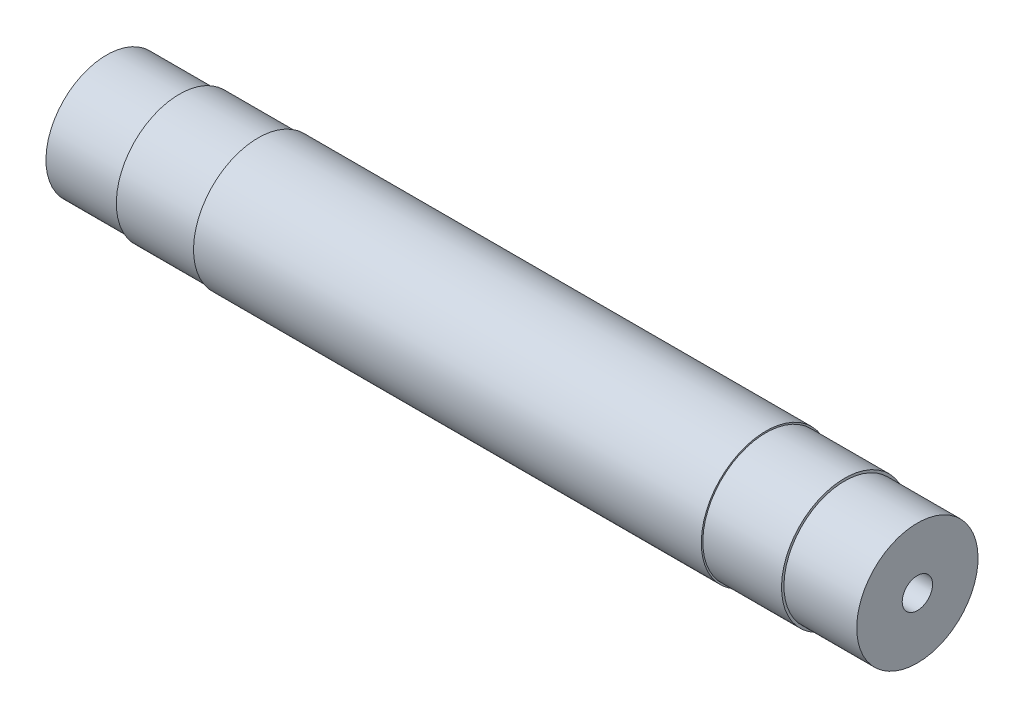
ISO-10303-21;
HEADER;
FILE_DESCRIPTION(('STEP AP214'),'2;1');
FILE_NAME('part.step','',(''),(''),'','','');
FILE_SCHEMA(('AUTOMOTIVE_DESIGN { 1 0 10303 214 1 1 1 1 }'));
ENDSEC;
DATA;
#1=APPLICATION_CONTEXT('core data for automotive mechanical design processes');
#2=APPLICATION_PROTOCOL_DEFINITION('international standard','automotive_design',2000,#1);
#3=PRODUCT_CONTEXT('',#1,'mechanical');
#4=PRODUCT('Part','Part','',(#3));
#5=PRODUCT_RELATED_PRODUCT_CATEGORY('part','',(#4));
#6=PRODUCT_DEFINITION_FORMATION('','',#4);
#7=PRODUCT_DEFINITION_CONTEXT('part definition',#1,'design');
#8=PRODUCT_DEFINITION('design','',#6,#7);
#9=PRODUCT_DEFINITION_SHAPE('','',#8);
#10=(LENGTH_UNIT() NAMED_UNIT(*) SI_UNIT(.MILLI.,.METRE.));
#11=(NAMED_UNIT(*) PLANE_ANGLE_UNIT() SI_UNIT($,.RADIAN.));
#12=(NAMED_UNIT(*) SI_UNIT($,.STERADIAN.) SOLID_ANGLE_UNIT());
#13=UNCERTAINTY_MEASURE_WITH_UNIT(LENGTH_MEASURE(1.E-05),#10,'distance_accuracy_value','');
#14=(GEOMETRIC_REPRESENTATION_CONTEXT(3) GLOBAL_UNCERTAINTY_ASSIGNED_CONTEXT((#13)) GLOBAL_UNIT_ASSIGNED_CONTEXT((#10,
#11,#12)) REPRESENTATION_CONTEXT('',''));
#15=CARTESIAN_POINT('',(0.,0.,0.));
#16=DIRECTION('',(0.,0.,1.));
#17=DIRECTION('',(1.,0.,0.));
#18=AXIS2_PLACEMENT_3D('',#15,#16,#17);
#19=CARTESIAN_POINT('',(-66.8415687782517,0.,0.));
#20=DIRECTION('',(-1.,0.,0.));
#21=DIRECTION('',(0.,-1.,0.));
#22=AXIS2_PLACEMENT_3D('',#19,#20,#21);
#23=CYLINDRICAL_SURFACE('',#22,10.65);
#24=CARTESIAN_POINT('',(-41.8613726809703,0.,0.));
#25=DIRECTION('',(-1.,0.,0.));
#26=DIRECTION('',(0.,-1.,0.));
#27=AXIS2_PLACEMENT_3D('',#24,#25,#26);
#28=CIRCLE('',#27,10.65);
#29=CARTESIAN_POINT('',(-41.8613726809703,-10.65,0.));
#30=VERTEX_POINT('',#29);
#31=EDGE_CURVE('E13',#30,#30,#28,.T.);
#32=ORIENTED_EDGE('',*,*,#31,.F.);
#33=EDGE_LOOP('',(#32));
#34=FACE_BOUND('',#33,.T.);
#35=CARTESIAN_POINT('',(41.8613726809703,0.,0.));
#36=DIRECTION('',(-1.,0.,0.));
#37=DIRECTION('',(0.,-1.,0.));
#38=AXIS2_PLACEMENT_3D('',#35,#36,#37);
#39=CIRCLE('',#38,10.65);
#40=CARTESIAN_POINT('',(41.8613726809703,-10.65,0.));
#41=VERTEX_POINT('',#40);
#42=EDGE_CURVE('E92',#41,#41,#39,.T.);
#43=ORIENTED_EDGE('',*,*,#42,.T.);
#44=EDGE_LOOP('',(#43));
#45=FACE_BOUND('',#44,.T.);
#46=ADVANCED_FACE('F52',(#34,#45),#23,.T.);
#47=CARTESIAN_POINT('',(-41.8613726809703,10.65,0.));
#48=DIRECTION('',(1.,0.,0.));
#49=DIRECTION('',(0.,1.,0.));
#50=AXIS2_PLACEMENT_3D('',#47,#48,#49);
#51=PLANE('',#50);
#52=CARTESIAN_POINT('',(-41.8613726809703,0.,0.));
#53=DIRECTION('',(-1.,0.,0.));
#54=DIRECTION('',(0.,-1.,0.));
#55=AXIS2_PLACEMENT_3D('',#52,#53,#54);
#56=CIRCLE('',#55,10.4);
#57=CARTESIAN_POINT('',(-41.8613726809703,-10.4,0.));
#58=VERTEX_POINT('',#57);
#59=EDGE_CURVE('E59',#58,#58,#56,.T.);
#60=ORIENTED_EDGE('',*,*,#59,.F.);
#61=EDGE_LOOP('',(#60));
#62=FACE_BOUND('',#61,.T.);
#63=ORIENTED_EDGE('',*,*,#31,.T.);
#64=EDGE_LOOP('',(#63));
#65=FACE_BOUND('',#64,.T.);
#66=ADVANCED_FACE('F114',(#62,#65),#51,.F.);
#67=CARTESIAN_POINT('',(-66.8415687782517,0.,0.));
#68=DIRECTION('',(-1.,0.,0.));
#69=DIRECTION('',(0.,-1.,0.));
#70=AXIS2_PLACEMENT_3D('',#67,#68,#69);
#71=CYLINDRICAL_SURFACE('',#70,10.4);
#72=CARTESIAN_POINT('',(-54.8415687782517,0.,0.));
#73=DIRECTION('',(-1.,0.,0.));
#74=DIRECTION('',(0.,-1.,0.));
#75=AXIS2_PLACEMENT_3D('',#72,#73,#74);
#76=CIRCLE('',#75,10.4);
#77=CARTESIAN_POINT('',(-54.8415687782517,-10.4,0.));
#78=VERTEX_POINT('',#77);
#79=EDGE_CURVE('E107',#78,#78,#76,.T.);
#80=ORIENTED_EDGE('',*,*,#79,.F.);
#81=EDGE_LOOP('',(#80));
#82=FACE_BOUND('',#81,.T.);
#83=ORIENTED_EDGE('',*,*,#59,.T.);
#84=EDGE_LOOP('',(#83));
#85=FACE_BOUND('',#84,.T.);
#86=ADVANCED_FACE('F112',(#82,#85),#71,.T.);
#87=CARTESIAN_POINT('',(-54.8415687782517,10.4,0.));
#88=DIRECTION('',(1.,0.,0.));
#89=DIRECTION('',(0.,1.,0.));
#90=AXIS2_PLACEMENT_3D('',#87,#88,#89);
#91=PLANE('',#90);
#92=CARTESIAN_POINT('',(-54.8415687782517,0.,0.));
#93=DIRECTION('',(-1.,0.,0.));
#94=DIRECTION('',(0.,-1.,0.));
#95=AXIS2_PLACEMENT_3D('',#92,#93,#94);
#96=CIRCLE('',#95,10.);
#97=CARTESIAN_POINT('',(-54.8415687782517,-10.,0.));
#98=VERTEX_POINT('',#97);
#99=EDGE_CURVE('E104',#98,#98,#96,.T.);
#100=ORIENTED_EDGE('',*,*,#99,.F.);
#101=EDGE_LOOP('',(#100));
#102=FACE_BOUND('',#101,.T.);
#103=ORIENTED_EDGE('',*,*,#79,.T.);
#104=EDGE_LOOP('',(#103));
#105=FACE_BOUND('',#104,.T.);
#106=ADVANCED_FACE('F150',(#102,#105),#91,.F.);
#107=CARTESIAN_POINT('',(-66.8415687782517,0.,0.));
#108=DIRECTION('',(-1.,0.,0.));
#109=DIRECTION('',(0.,-1.,0.));
#110=AXIS2_PLACEMENT_3D('',#107,#108,#109);
#111=CYLINDRICAL_SURFACE('',#110,10.);
#112=CARTESIAN_POINT('',(-66.8415687782517,0.,0.));
#113=DIRECTION('',(-1.,0.,0.));
#114=DIRECTION('',(0.,-1.,0.));
#115=AXIS2_PLACEMENT_3D('',#112,#113,#114);
#116=CIRCLE('',#115,10.);
#117=CARTESIAN_POINT('',(-66.8415687782517,-10.,0.));
#118=VERTEX_POINT('',#117);
#119=EDGE_CURVE('E101',#118,#118,#116,.T.);
#120=ORIENTED_EDGE('',*,*,#119,.F.);
#121=EDGE_LOOP('',(#120));
#122=FACE_BOUND('',#121,.T.);
#123=ORIENTED_EDGE('',*,*,#99,.T.);
#124=EDGE_LOOP('',(#123));
#125=FACE_BOUND('',#124,.T.);
#126=ADVANCED_FACE('F146',(#122,#125),#111,.T.);
#127=CARTESIAN_POINT('',(-66.8415687782517,0.,0.));
#128=DIRECTION('',(1.,0.,0.));
#129=DIRECTION('',(0.,1.,0.));
#130=AXIS2_PLACEMENT_3D('',#127,#128,#129);
#131=PLANE('',#130);
#132=CARTESIAN_POINT('',(-66.8415687782517,0.,0.));
#133=DIRECTION('',(-1.,0.,0.));
#134=DIRECTION('',(0.,0.,1.));
#135=AXIS2_PLACEMENT_3D('',#132,#133,#134);
#136=CIRCLE('',#135,2.5);
#137=CARTESIAN_POINT('',(-66.8415687782517,0.,2.5));
#138=VERTEX_POINT('',#137);
#139=EDGE_CURVE('E95',#138,#138,#136,.T.);
#140=ORIENTED_EDGE('',*,*,#139,.F.);
#141=EDGE_LOOP('',(#140));
#142=FACE_BOUND('',#141,.T.);
#143=ORIENTED_EDGE('',*,*,#119,.T.);
#144=EDGE_LOOP('',(#143));
#145=FACE_BOUND('',#144,.T.);
#146=ADVANCED_FACE('F143',(#142,#145),#131,.F.);
#147=CARTESIAN_POINT('',(-39.8415687782517,0.,0.));
#148=DIRECTION('',(-1.,0.,0.));
#149=DIRECTION('',(0.,0.,1.));
#150=AXIS2_PLACEMENT_3D('',#147,#148,#149);
#151=CONICAL_SURFACE('',#150,2.49999999999999,1.02974425867665);
#152=CARTESIAN_POINT('',(-38.3394172306828,0.,0.));
#153=VERTEX_POINT('',#152);
#154=VERTEX_LOOP('',#153);
#155=FACE_BOUND('',#154,.T.);
#156=CARTESIAN_POINT('',(-39.8415687782517,0.,0.));
#157=DIRECTION('',(-1.,0.,0.));
#158=DIRECTION('',(0.,0.,1.));
#159=AXIS2_PLACEMENT_3D('',#156,#157,#158);
#160=CIRCLE('',#159,2.49999999999999);
#161=CARTESIAN_POINT('',(-39.8415687782517,0.,2.49999999999999));
#162=VERTEX_POINT('',#161);
#163=EDGE_CURVE('E98',#162,#162,#160,.T.);
#164=ORIENTED_EDGE('',*,*,#163,.T.);
#165=EDGE_LOOP('',(#164));
#166=FACE_BOUND('',#165,.T.);
#167=ADVANCED_FACE('F136',(#155,#166),#151,.F.);
#168=CARTESIAN_POINT('',(-66.8415687782517,0.,0.));
#169=DIRECTION('',(-1.,0.,0.));
#170=DIRECTION('',(0.,0.,1.));
#171=AXIS2_PLACEMENT_3D('',#168,#169,#170);
#172=CYLINDRICAL_SURFACE('',#171,2.5);
#173=ORIENTED_EDGE('',*,*,#163,.F.);
#174=EDGE_LOOP('',(#173));
#175=FACE_BOUND('',#174,.T.);
#176=ORIENTED_EDGE('',*,*,#139,.T.);
#177=EDGE_LOOP('',(#176));
#178=FACE_BOUND('',#177,.T.);
#179=ADVANCED_FACE('F126',(#175,#178),#172,.F.);
#180=CARTESIAN_POINT('',(41.8613726809703,10.65,0.));
#181=DIRECTION('',(-1.,0.,0.));
#182=DIRECTION('',(0.,1.,0.));
#183=AXIS2_PLACEMENT_3D('',#180,#181,#182);
#184=PLANE('',#183);
#185=CARTESIAN_POINT('',(41.8613726809703,0.,0.));
#186=DIRECTION('',(-1.,0.,0.));
#187=DIRECTION('',(0.,-1.,0.));
#188=AXIS2_PLACEMENT_3D('',#185,#186,#187);
#189=CIRCLE('',#188,10.4);
#190=CARTESIAN_POINT('',(41.8613726809703,-10.4,0.));
#191=VERTEX_POINT('',#190);
#192=EDGE_CURVE('E89',#191,#191,#189,.T.);
#193=ORIENTED_EDGE('',*,*,#192,.T.);
#194=EDGE_LOOP('',(#193));
#195=FACE_BOUND('',#194,.T.);
#196=ORIENTED_EDGE('',*,*,#42,.F.);
#197=EDGE_LOOP('',(#196));
#198=FACE_BOUND('',#197,.T.);
#199=ADVANCED_FACE('F123',(#195,#198),#184,.F.);
#200=CARTESIAN_POINT('',(66.8415687782517,0.,0.));
#201=DIRECTION('',(1.,0.,0.));
#202=DIRECTION('',(0.,-1.,0.));
#203=AXIS2_PLACEMENT_3D('',#200,#201,#202);
#204=CYLINDRICAL_SURFACE('',#203,10.4);
#205=CARTESIAN_POINT('',(54.8415687782517,0.,0.));
#206=DIRECTION('',(-1.,0.,0.));
#207=DIRECTION('',(0.,-1.,0.));
#208=AXIS2_PLACEMENT_3D('',#205,#206,#207);
#209=CIRCLE('',#208,10.4);
#210=CARTESIAN_POINT('',(54.8415687782517,-10.4,0.));
#211=VERTEX_POINT('',#210);
#212=EDGE_CURVE('E86',#211,#211,#209,.T.);
#213=ORIENTED_EDGE('',*,*,#212,.T.);
#214=EDGE_LOOP('',(#213));
#215=FACE_BOUND('',#214,.T.);
#216=ORIENTED_EDGE('',*,*,#192,.F.);
#217=EDGE_LOOP('',(#216));
#218=FACE_BOUND('',#217,.T.);
#219=ADVANCED_FACE('F125',(#215,#218),#204,.T.);
#220=CARTESIAN_POINT('',(54.8415687782517,10.4,0.));
#221=DIRECTION('',(-1.,0.,0.));
#222=DIRECTION('',(0.,1.,0.));
#223=AXIS2_PLACEMENT_3D('',#220,#221,#222);
#224=PLANE('',#223);
#225=CARTESIAN_POINT('',(54.8415687782517,0.,0.));
#226=DIRECTION('',(-1.,0.,0.));
#227=DIRECTION('',(0.,-1.,0.));
#228=AXIS2_PLACEMENT_3D('',#225,#226,#227);
#229=CIRCLE('',#228,10.);
#230=CARTESIAN_POINT('',(54.8415687782517,-10.,0.));
#231=VERTEX_POINT('',#230);
#232=EDGE_CURVE('E79',#231,#231,#229,.T.);
#233=ORIENTED_EDGE('',*,*,#232,.T.);
#234=EDGE_LOOP('',(#233));
#235=FACE_BOUND('',#234,.T.);
#236=ORIENTED_EDGE('',*,*,#212,.F.);
#237=EDGE_LOOP('',(#236));
#238=FACE_BOUND('',#237,.T.);
#239=ADVANCED_FACE('F133',(#235,#238),#224,.F.);
#240=CARTESIAN_POINT('',(66.8415687782517,0.,0.));
#241=DIRECTION('',(1.,0.,0.));
#242=DIRECTION('',(0.,-1.,0.));
#243=AXIS2_PLACEMENT_3D('',#240,#241,#242);
#244=CYLINDRICAL_SURFACE('',#243,10.);
#245=CARTESIAN_POINT('',(66.8415687782517,0.,0.));
#246=DIRECTION('',(-1.,0.,0.));
#247=DIRECTION('',(0.,-1.,0.));
#248=AXIS2_PLACEMENT_3D('',#245,#246,#247);
#249=CIRCLE('',#248,10.);
#250=CARTESIAN_POINT('',(66.8415687782517,-10.,0.));
#251=VERTEX_POINT('',#250);
#252=EDGE_CURVE('E75',#251,#251,#249,.T.);
#253=ORIENTED_EDGE('',*,*,#252,.T.);
#254=EDGE_LOOP('',(#253));
#255=FACE_BOUND('',#254,.T.);
#256=ORIENTED_EDGE('',*,*,#232,.F.);
#257=EDGE_LOOP('',(#256));
#258=FACE_BOUND('',#257,.T.);
#259=ADVANCED_FACE('F209',(#255,#258),#244,.T.);
#260=CARTESIAN_POINT('',(66.8415687782517,0.,0.));
#261=DIRECTION('',(-1.,0.,0.));
#262=DIRECTION('',(0.,1.,0.));
#263=AXIS2_PLACEMENT_3D('',#260,#261,#262);
#264=PLANE('',#263);
#265=CARTESIAN_POINT('',(66.8415687782517,0.,0.));
#266=DIRECTION('',(-1.,0.,0.));
#267=DIRECTION('',(0.,0.,1.));
#268=AXIS2_PLACEMENT_3D('',#265,#266,#267);
#269=CIRCLE('',#268,2.5);
#270=CARTESIAN_POINT('',(66.8415687782517,0.,2.5));
#271=VERTEX_POINT('',#270);
#272=EDGE_CURVE('E76',#271,#271,#269,.T.);
#273=ORIENTED_EDGE('',*,*,#272,.T.);
#274=EDGE_LOOP('',(#273));
#275=FACE_BOUND('',#274,.T.);
#276=ORIENTED_EDGE('',*,*,#252,.F.);
#277=EDGE_LOOP('',(#276));
#278=FACE_BOUND('',#277,.T.);
#279=ADVANCED_FACE('F69',(#275,#278),#264,.F.);
#280=CARTESIAN_POINT('',(39.8415687782517,0.,0.));
#281=DIRECTION('',(1.,0.,0.));
#282=DIRECTION('',(0.,0.,1.));
#283=AXIS2_PLACEMENT_3D('',#280,#281,#282);
#284=CONICAL_SURFACE('',#283,2.49999999999999,1.02974425867665);
#285=CARTESIAN_POINT('',(38.3394172306828,0.,0.));
#286=VERTEX_POINT('',#285);
#287=VERTEX_LOOP('',#286);
#288=FACE_BOUND('',#287,.T.);
#289=CARTESIAN_POINT('',(39.8415687782517,0.,0.));
#290=DIRECTION('',(-1.,0.,0.));
#291=DIRECTION('',(0.,0.,1.));
#292=AXIS2_PLACEMENT_3D('',#289,#290,#291);
#293=CIRCLE('',#292,2.49999999999999);
#294=CARTESIAN_POINT('',(39.8415687782517,0.,2.49999999999999));
#295=VERTEX_POINT('',#294);
#296=EDGE_CURVE('E73',#295,#295,#293,.T.);
#297=ORIENTED_EDGE('',*,*,#296,.F.);
#298=EDGE_LOOP('',(#297));
#299=FACE_BOUND('',#298,.T.);
#300=ADVANCED_FACE('F65',(#288,#299),#284,.F.);
#301=CARTESIAN_POINT('',(66.8415687782517,0.,0.));
#302=DIRECTION('',(1.,0.,0.));
#303=DIRECTION('',(0.,0.,1.));
#304=AXIS2_PLACEMENT_3D('',#301,#302,#303);
#305=CYLINDRICAL_SURFACE('',#304,2.5);
#306=ORIENTED_EDGE('',*,*,#296,.T.);
#307=EDGE_LOOP('',(#306));
#308=FACE_BOUND('',#307,.T.);
#309=ORIENTED_EDGE('',*,*,#272,.F.);
#310=EDGE_LOOP('',(#309));
#311=FACE_BOUND('',#310,.T.);
#312=ADVANCED_FACE('F68',(#308,#311),#305,.F.);
#313=CLOSED_SHELL('',(#46,#66,#86,#106,#126,#146,#167,#179,#199,#219,#239,#259,#279,#300,#312));
#314=MANIFOLD_SOLID_BREP('B2',#313);
#315=ADVANCED_BREP_SHAPE_REPRESENTATION('',(#18,#314),#14);
#316=SHAPE_DEFINITION_REPRESENTATION(#9,#315);
ENDSEC;
END-ISO-10303-21;
